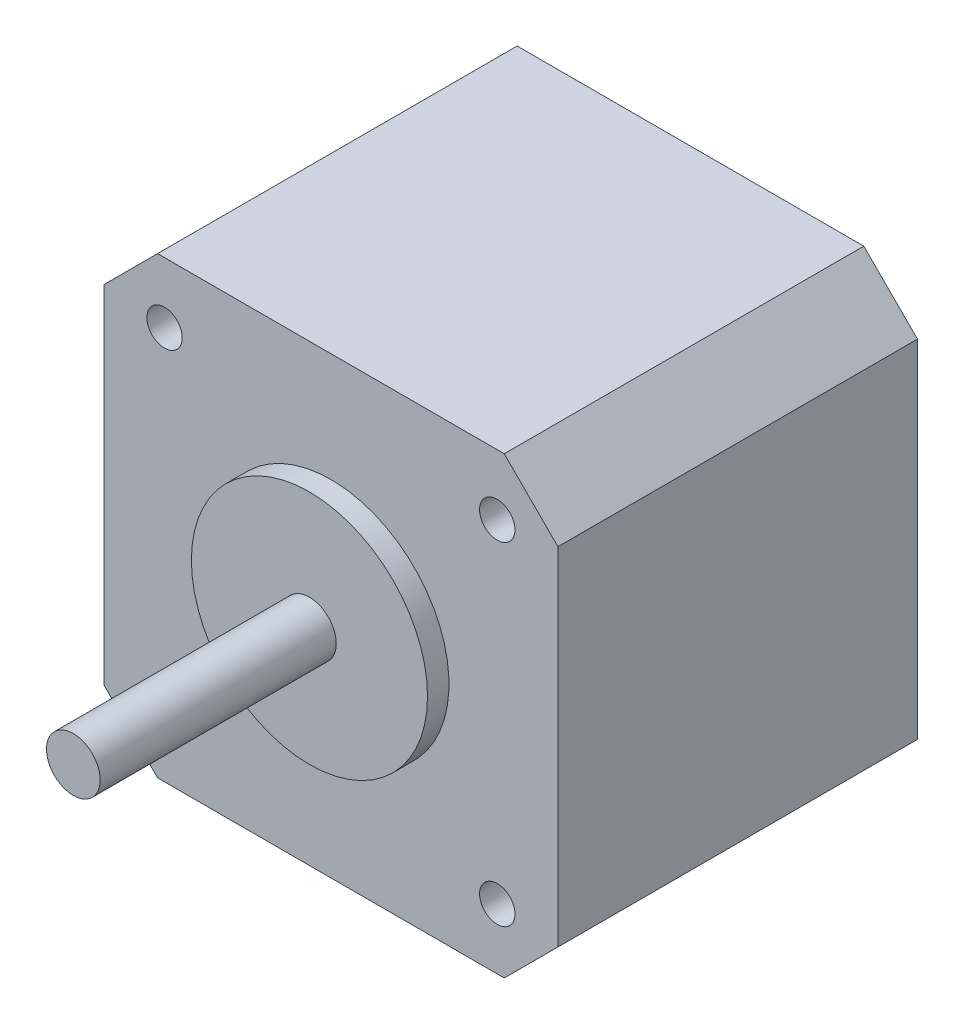
ISO-10303-21;
HEADER;
FILE_DESCRIPTION(('STEP AP214'),'2;1');
FILE_NAME('part.step','',(''),(''),'','','');
FILE_SCHEMA(('AUTOMOTIVE_DESIGN { 1 0 10303 214 1 1 1 1 }'));
ENDSEC;
DATA;
#1=APPLICATION_CONTEXT('core data for automotive mechanical design processes');
#2=APPLICATION_PROTOCOL_DEFINITION('international standard','automotive_design',2000,#1);
#3=PRODUCT_CONTEXT('',#1,'mechanical');
#4=PRODUCT('Part','Part','',(#3));
#5=PRODUCT_RELATED_PRODUCT_CATEGORY('part','',(#4));
#6=PRODUCT_DEFINITION_FORMATION('','',#4);
#7=PRODUCT_DEFINITION_CONTEXT('part definition',#1,'design');
#8=PRODUCT_DEFINITION('design','',#6,#7);
#9=PRODUCT_DEFINITION_SHAPE('','',#8);
#10=(LENGTH_UNIT() NAMED_UNIT(*) SI_UNIT(.MILLI.,.METRE.));
#11=(NAMED_UNIT(*) PLANE_ANGLE_UNIT() SI_UNIT($,.RADIAN.));
#12=(NAMED_UNIT(*) SI_UNIT($,.STERADIAN.) SOLID_ANGLE_UNIT());
#13=UNCERTAINTY_MEASURE_WITH_UNIT(LENGTH_MEASURE(1.E-05),#10,'distance_accuracy_value','');
#14=(GEOMETRIC_REPRESENTATION_CONTEXT(3) GLOBAL_UNCERTAINTY_ASSIGNED_CONTEXT((#13)) GLOBAL_UNIT_ASSIGNED_CONTEXT((#10,
#11,#12)) REPRESENTATION_CONTEXT('',''));
#15=CARTESIAN_POINT('',(0.,0.,0.));
#16=DIRECTION('',(0.,0.,1.));
#17=DIRECTION('',(1.,0.,0.));
#18=AXIS2_PLACEMENT_3D('',#15,#16,#17);
#19=CARTESIAN_POINT('',(0.,0.,33.5));
#20=DIRECTION('',(0.,1.,0.));
#21=DIRECTION('',(0.,0.,1.));
#22=AXIS2_PLACEMENT_3D('',#19,#20,#21);
#23=PLANE('',#22);
#24=DIRECTION('',(1.,0.,0.));
#25=VECTOR('',#24,1.);
#26=CARTESIAN_POINT('',(0.,0.,33.5));
#27=LINE('',#26,#25);
#28=CARTESIAN_POINT('',(5.00000000000002,0.,33.5));
#29=VERTEX_POINT('',#28);
#30=CARTESIAN_POINT('',(37.3,0.,33.5));
#31=VERTEX_POINT('',#30);
#32=EDGE_CURVE('E247',#29,#31,#27,.T.);
#33=ORIENTED_EDGE('',*,*,#32,.F.);
#34=DIRECTION('',(0.,0.,-1.));
#35=VECTOR('',#34,1.);
#36=CARTESIAN_POINT('',(5.00000000000002,0.,33.5));
#37=LINE('',#36,#35);
#38=CARTESIAN_POINT('',(5.00000000000003,0.,0.));
#39=VERTEX_POINT('',#38);
#40=EDGE_CURVE('E338',#29,#39,#37,.T.);
#41=ORIENTED_EDGE('',*,*,#40,.T.);
#42=DIRECTION('',(1.,0.,0.));
#43=VECTOR('',#42,1.);
#44=CARTESIAN_POINT('',(0.,0.,0.));
#45=LINE('',#44,#43);
#46=CARTESIAN_POINT('',(10.5,0.,0.));
#47=VERTEX_POINT('',#46);
#48=EDGE_CURVE('E169',#39,#47,#45,.T.);
#49=ORIENTED_EDGE('',*,*,#48,.T.);
#50=DIRECTION('',(0.,0.,-1.));
#51=VECTOR('',#50,1.);
#52=CARTESIAN_POINT('',(10.5,0.,7.15));
#53=LINE('',#52,#51);
#54=CARTESIAN_POINT('',(10.5,0.,7.15));
#55=VERTEX_POINT('',#54);
#56=EDGE_CURVE('E160',#55,#47,#53,.T.);
#57=ORIENTED_EDGE('',*,*,#56,.F.);
#58=DIRECTION('',(1.,0.,0.));
#59=VECTOR('',#58,1.);
#60=CARTESIAN_POINT('',(31.8,0.,7.15));
#61=LINE('',#60,#59);
#62=CARTESIAN_POINT('',(31.8,0.,7.15));
#63=VERTEX_POINT('',#62);
#64=EDGE_CURVE('E131',#55,#63,#61,.T.);
#65=ORIENTED_EDGE('',*,*,#64,.T.);
#66=DIRECTION('',(0.,0.,-1.));
#67=VECTOR('',#66,1.);
#68=CARTESIAN_POINT('',(31.8,0.,7.15));
#69=LINE('',#68,#67);
#70=CARTESIAN_POINT('',(31.8,0.,0.));
#71=VERTEX_POINT('',#70);
#72=EDGE_CURVE('E144',#63,#71,#69,.T.);
#73=ORIENTED_EDGE('',*,*,#72,.T.);
#74=CARTESIAN_POINT('',(37.3,0.,0.));
#75=VERTEX_POINT('',#74);
#76=EDGE_CURVE('E173',#71,#75,#45,.T.);
#77=ORIENTED_EDGE('',*,*,#76,.T.);
#78=DIRECTION('',(0.,0.,1.));
#79=VECTOR('',#78,1.);
#80=CARTESIAN_POINT('',(37.3,0.,33.5));
#81=LINE('',#80,#79);
#82=EDGE_CURVE('E174',#75,#31,#81,.T.);
#83=ORIENTED_EDGE('',*,*,#82,.T.);
#84=EDGE_LOOP('',(#33,#41,#49,#57,#65,#73,#77,#83));
#85=FACE_BOUND('',#84,.T.);
#86=ADVANCED_FACE('F31',(#85),#23,.F.);
#87=CARTESIAN_POINT('',(0.,42.3,33.5));
#88=DIRECTION('',(0.,0.,-1.));
#89=DIRECTION('',(-1.,0.,0.));
#90=AXIS2_PLACEMENT_3D('',#87,#88,#89);
#91=PLANE('',#90);
#92=DIRECTION('',(0.,-1.,0.));
#93=VECTOR('',#92,1.);
#94=CARTESIAN_POINT('',(0.,0.,33.5));
#95=LINE('',#94,#93);
#96=CARTESIAN_POINT('',(0.,37.3,33.5));
#97=VERTEX_POINT('',#96);
#98=CARTESIAN_POINT('',(0.,5.00000000000002,33.5));
#99=VERTEX_POINT('',#98);
#100=EDGE_CURVE('E246',#97,#99,#95,.T.);
#101=ORIENTED_EDGE('',*,*,#100,.T.);
#102=DIRECTION('',(-0.707106781186548,0.707106781186548,0.));
#103=VECTOR('',#102,1.);
#104=CARTESIAN_POINT('',(5.00000000000002,0.,33.5));
#105=LINE('',#104,#103);
#106=EDGE_CURVE('E219',#99,#29,#105,.F.);
#107=ORIENTED_EDGE('',*,*,#106,.T.);
#108=ORIENTED_EDGE('',*,*,#32,.T.);
#109=DIRECTION('',(-0.707106781186547,-0.707106781186549,0.));
#110=VECTOR('',#109,1.);
#111=CARTESIAN_POINT('',(42.3,5.00000000000002,33.5));
#112=LINE('',#111,#110);
#113=CARTESIAN_POINT('',(42.3,5.00000000000002,33.5));
#114=VERTEX_POINT('',#113);
#115=EDGE_CURVE('E226',#31,#114,#112,.F.);
#116=ORIENTED_EDGE('',*,*,#115,.T.);
#117=DIRECTION('',(0.,1.,0.));
#118=VECTOR('',#117,1.);
#119=CARTESIAN_POINT('',(42.3,0.,33.5));
#120=LINE('',#119,#118);
#121=CARTESIAN_POINT('',(42.3,37.3,33.5));
#122=VERTEX_POINT('',#121);
#123=EDGE_CURVE('E240',#114,#122,#120,.T.);
#124=ORIENTED_EDGE('',*,*,#123,.T.);
#125=DIRECTION('',(0.707106781186548,-0.707106781186548,0.));
#126=VECTOR('',#125,1.);
#127=CARTESIAN_POINT('',(37.3,42.3,33.5));
#128=LINE('',#127,#126);
#129=CARTESIAN_POINT('',(37.3,42.3,33.5));
#130=VERTEX_POINT('',#129);
#131=EDGE_CURVE('E52',#122,#130,#128,.F.);
#132=ORIENTED_EDGE('',*,*,#131,.T.);
#133=DIRECTION('',(-1.,0.,0.));
#134=VECTOR('',#133,1.);
#135=CARTESIAN_POINT('',(0.,42.3,33.5));
#136=LINE('',#135,#134);
#137=CARTESIAN_POINT('',(5.00000000000002,42.3,33.5));
#138=VERTEX_POINT('',#137);
#139=EDGE_CURVE('E251',#130,#138,#136,.T.);
#140=ORIENTED_EDGE('',*,*,#139,.T.);
#141=DIRECTION('',(0.707106781186548,0.707106781186548,0.));
#142=VECTOR('',#141,1.);
#143=CARTESIAN_POINT('',(0.,37.3,33.5));
#144=LINE('',#143,#142);
#145=EDGE_CURVE('E220',#138,#97,#144,.F.);
#146=ORIENTED_EDGE('',*,*,#145,.T.);
#147=EDGE_LOOP('',(#101,#107,#108,#116,#124,#132,#140,#146));
#148=FACE_BOUND('',#147,.T.);
#149=CARTESIAN_POINT('',(5.65,36.65,33.5));
#150=DIRECTION('',(0.,0.,1.));
#151=DIRECTION('',(1.,0.,0.));
#152=AXIS2_PLACEMENT_3D('',#149,#150,#151);
#153=CIRCLE('',#152,1.65);
#154=CARTESIAN_POINT('',(7.3,36.65,33.5));
#155=VERTEX_POINT('',#154);
#156=EDGE_CURVE('E261',#155,#155,#153,.T.);
#157=ORIENTED_EDGE('',*,*,#156,.F.);
#158=EDGE_LOOP('',(#157));
#159=FACE_BOUND('',#158,.T.);
#160=CARTESIAN_POINT('',(36.65,36.65,33.5));
#161=DIRECTION('',(0.,0.,1.));
#162=DIRECTION('',(1.,0.,0.));
#163=AXIS2_PLACEMENT_3D('',#160,#161,#162);
#164=CIRCLE('',#163,1.65);
#165=CARTESIAN_POINT('',(38.3,36.65,33.5));
#166=VERTEX_POINT('',#165);
#167=EDGE_CURVE('E267',#166,#166,#164,.T.);
#168=ORIENTED_EDGE('',*,*,#167,.F.);
#169=EDGE_LOOP('',(#168));
#170=FACE_BOUND('',#169,.T.);
#171=CARTESIAN_POINT('',(5.65000000000032,5.65,33.5));
#172=DIRECTION('',(0.,0.,1.));
#173=DIRECTION('',(1.,0.,0.));
#174=AXIS2_PLACEMENT_3D('',#171,#172,#173);
#175=CIRCLE('',#174,1.65);
#176=CARTESIAN_POINT('',(7.30000000000032,5.65,33.5));
#177=VERTEX_POINT('',#176);
#178=EDGE_CURVE('E273',#177,#177,#175,.T.);
#179=ORIENTED_EDGE('',*,*,#178,.F.);
#180=EDGE_LOOP('',(#179));
#181=FACE_BOUND('',#180,.T.);
#182=CARTESIAN_POINT('',(36.6500000000003,5.65,33.5));
#183=DIRECTION('',(0.,0.,1.));
#184=DIRECTION('',(1.,0.,0.));
#185=AXIS2_PLACEMENT_3D('',#182,#183,#184);
#186=CIRCLE('',#185,1.65);
#187=CARTESIAN_POINT('',(38.3000000000003,5.65,33.5));
#188=VERTEX_POINT('',#187);
#189=EDGE_CURVE('E279',#188,#188,#186,.T.);
#190=ORIENTED_EDGE('',*,*,#189,.F.);
#191=EDGE_LOOP('',(#190));
#192=FACE_BOUND('',#191,.T.);
#193=CARTESIAN_POINT('',(21.15,21.15,33.5));
#194=DIRECTION('',(0.,0.,-1.));
#195=DIRECTION('',(-1.,0.,0.));
#196=AXIS2_PLACEMENT_3D('',#193,#194,#195);
#197=CIRCLE('',#196,11.);
#198=CARTESIAN_POINT('',(10.15,21.15,33.5));
#199=VERTEX_POINT('',#198);
#200=EDGE_CURVE('E249',#199,#199,#197,.F.);
#201=ORIENTED_EDGE('',*,*,#200,.F.);
#202=EDGE_LOOP('',(#201));
#203=FACE_BOUND('',#202,.T.);
#204=ADVANCED_FACE('F313',(#148,#159,#170,#181,#192,#203),#91,.F.);
#205=CARTESIAN_POINT('',(0.,0.,33.5));
#206=DIRECTION('',(1.,0.,0.));
#207=DIRECTION('',(0.,0.,-1.));
#208=AXIS2_PLACEMENT_3D('',#205,#206,#207);
#209=PLANE('',#208);
#210=DIRECTION('',(0.,-1.,0.));
#211=VECTOR('',#210,1.);
#212=CARTESIAN_POINT('',(0.,0.,0.));
#213=LINE('',#212,#211);
#214=CARTESIAN_POINT('',(0.,37.3,0.));
#215=VERTEX_POINT('',#214);
#216=CARTESIAN_POINT('',(0.,5.00000000000002,0.));
#217=VERTEX_POINT('',#216);
#218=EDGE_CURVE('E179',#215,#217,#213,.T.);
#219=ORIENTED_EDGE('',*,*,#218,.T.);
#220=DIRECTION('',(0.,0.,1.));
#221=VECTOR('',#220,1.);
#222=CARTESIAN_POINT('',(0.,5.00000000000002,33.5));
#223=LINE('',#222,#221);
#224=EDGE_CURVE('E213',#217,#99,#223,.T.);
#225=ORIENTED_EDGE('',*,*,#224,.T.);
#226=ORIENTED_EDGE('',*,*,#100,.F.);
#227=DIRECTION('',(0.,0.,-1.));
#228=VECTOR('',#227,1.);
#229=CARTESIAN_POINT('',(0.,37.3,33.5));
#230=LINE('',#229,#228);
#231=EDGE_CURVE('E206',#97,#215,#230,.T.);
#232=ORIENTED_EDGE('',*,*,#231,.T.);
#233=EDGE_LOOP('',(#219,#225,#226,#232));
#234=FACE_BOUND('',#233,.T.);
#235=ADVANCED_FACE('F211',(#234),#209,.F.);
#236=CARTESIAN_POINT('',(42.3,0.,33.5));
#237=DIRECTION('',(-1.,0.,0.));
#238=DIRECTION('',(0.,0.,1.));
#239=AXIS2_PLACEMENT_3D('',#236,#237,#238);
#240=PLANE('',#239);
#241=ORIENTED_EDGE('',*,*,#123,.F.);
#242=DIRECTION('',(0.,0.,-1.));
#243=VECTOR('',#242,1.);
#244=CARTESIAN_POINT('',(42.3,5.00000000000002,33.5));
#245=LINE('',#244,#243);
#246=CARTESIAN_POINT('',(42.3,5.,0.));
#247=VERTEX_POINT('',#246);
#248=EDGE_CURVE('E231',#114,#247,#245,.T.);
#249=ORIENTED_EDGE('',*,*,#248,.T.);
#250=DIRECTION('',(0.,1.,0.));
#251=VECTOR('',#250,1.);
#252=CARTESIAN_POINT('',(42.3,0.,0.));
#253=LINE('',#252,#251);
#254=CARTESIAN_POINT('',(42.3,37.3,0.));
#255=VERTEX_POINT('',#254);
#256=EDGE_CURVE('E172',#247,#255,#253,.T.);
#257=ORIENTED_EDGE('',*,*,#256,.T.);
#258=DIRECTION('',(0.,0.,1.));
#259=VECTOR('',#258,1.);
#260=CARTESIAN_POINT('',(42.3,37.3,33.5));
#261=LINE('',#260,#259);
#262=EDGE_CURVE('E229',#255,#122,#261,.T.);
#263=ORIENTED_EDGE('',*,*,#262,.T.);
#264=EDGE_LOOP('',(#241,#249,#257,#263));
#265=FACE_BOUND('',#264,.T.);
#266=ADVANCED_FACE('F238',(#265),#240,.F.);
#267=CARTESIAN_POINT('',(0.,42.3,33.5));
#268=DIRECTION('',(0.,-1.,0.));
#269=DIRECTION('',(0.,0.,-1.));
#270=AXIS2_PLACEMENT_3D('',#267,#268,#269);
#271=PLANE('',#270);
#272=ORIENTED_EDGE('',*,*,#139,.F.);
#273=DIRECTION('',(0.,0.,-1.));
#274=VECTOR('',#273,1.);
#275=CARTESIAN_POINT('',(37.3,42.3,33.5));
#276=LINE('',#275,#274);
#277=CARTESIAN_POINT('',(37.3,42.3,0.));
#278=VERTEX_POINT('',#277);
#279=EDGE_CURVE('E11',#130,#278,#276,.T.);
#280=ORIENTED_EDGE('',*,*,#279,.T.);
#281=DIRECTION('',(-1.,0.,0.));
#282=VECTOR('',#281,1.);
#283=CARTESIAN_POINT('',(0.,42.3,0.));
#284=LINE('',#283,#282);
#285=CARTESIAN_POINT('',(5.00000000000002,42.3,0.));
#286=VERTEX_POINT('',#285);
#287=EDGE_CURVE('E245',#278,#286,#284,.T.);
#288=ORIENTED_EDGE('',*,*,#287,.T.);
#289=DIRECTION('',(0.,0.,1.));
#290=VECTOR('',#289,1.);
#291=CARTESIAN_POINT('',(5.00000000000002,42.3,33.5));
#292=LINE('',#291,#290);
#293=EDGE_CURVE('E39',#286,#138,#292,.T.);
#294=ORIENTED_EDGE('',*,*,#293,.T.);
#295=EDGE_LOOP('',(#272,#280,#288,#294));
#296=FACE_BOUND('',#295,.T.);
#297=ADVANCED_FACE('F336',(#296),#271,.F.);
#298=CARTESIAN_POINT('',(0.,42.3,0.));
#299=DIRECTION('',(0.,0.,-1.));
#300=DIRECTION('',(-1.,0.,0.));
#301=AXIS2_PLACEMENT_3D('',#298,#299,#300);
#302=PLANE('',#301);
#303=CARTESIAN_POINT('',(21.15,21.15,0.));
#304=DIRECTION('',(0.,0.,-1.));
#305=DIRECTION('',(-1.,0.,0.));
#306=AXIS2_PLACEMENT_3D('',#303,#304,#305);
#307=CIRCLE('',#306,2.5);
#308=CARTESIAN_POINT('',(18.65,21.15,0.));
#309=VERTEX_POINT('',#308);
#310=EDGE_CURVE('E255',#309,#309,#307,.T.);
#311=ORIENTED_EDGE('',*,*,#310,.F.);
#312=EDGE_LOOP('',(#311));
#313=FACE_BOUND('',#312,.T.);
#314=ORIENTED_EDGE('',*,*,#48,.F.);
#315=DIRECTION('',(0.707106781186548,-0.707106781186548,0.));
#316=VECTOR('',#315,1.);
#317=CARTESIAN_POINT('',(-18.65,23.65,0.));
#318=LINE('',#317,#316);
#319=EDGE_CURVE('E201',#39,#217,#318,.F.);
#320=ORIENTED_EDGE('',*,*,#319,.T.);
#321=ORIENTED_EDGE('',*,*,#218,.F.);
#322=DIRECTION('',(-0.707106781186548,-0.707106781186548,0.));
#323=VECTOR('',#322,1.);
#324=CARTESIAN_POINT('',(2.50000000000001,39.8,0.));
#325=LINE('',#324,#323);
#326=EDGE_CURVE('E337',#215,#286,#325,.F.);
#327=ORIENTED_EDGE('',*,*,#326,.T.);
#328=ORIENTED_EDGE('',*,*,#287,.F.);
#329=DIRECTION('',(-0.707106781186548,0.707106781186548,0.));
#330=VECTOR('',#329,1.);
#331=CARTESIAN_POINT('',(18.65,60.95,0.));
#332=LINE('',#331,#330);
#333=EDGE_CURVE('E244',#278,#255,#332,.F.);
#334=ORIENTED_EDGE('',*,*,#333,.T.);
#335=ORIENTED_EDGE('',*,*,#256,.F.);
#336=DIRECTION('',(0.707106781186547,0.707106781186549,0.));
#337=VECTOR('',#336,1.);
#338=CARTESIAN_POINT('',(39.8000000000001,2.50000000000006,0.));
#339=LINE('',#338,#337);
#340=EDGE_CURVE('E207',#247,#75,#339,.F.);
#341=ORIENTED_EDGE('',*,*,#340,.T.);
#342=ORIENTED_EDGE('',*,*,#76,.F.);
#343=DIRECTION('',(0.,-1.,0.));
#344=VECTOR('',#343,1.);
#345=CARTESIAN_POINT('',(31.8,0.,0.));
#346=LINE('',#345,#344);
#347=CARTESIAN_POINT('',(31.8,-2.8,0.));
#348=VERTEX_POINT('',#347);
#349=EDGE_CURVE('E153',#71,#348,#346,.T.);
#350=ORIENTED_EDGE('',*,*,#349,.T.);
#351=DIRECTION('',(-1.,0.,0.));
#352=VECTOR('',#351,1.);
#353=CARTESIAN_POINT('',(31.8,-2.8,0.));
#354=LINE('',#353,#352);
#355=CARTESIAN_POINT('',(10.5,-2.8,0.));
#356=VERTEX_POINT('',#355);
#357=EDGE_CURVE('E126',#348,#356,#354,.T.);
#358=ORIENTED_EDGE('',*,*,#357,.T.);
#359=DIRECTION('',(0.,1.,0.));
#360=VECTOR('',#359,1.);
#361=CARTESIAN_POINT('',(10.5,0.,0.));
#362=LINE('',#361,#360);
#363=EDGE_CURVE('E145',#356,#47,#362,.T.);
#364=ORIENTED_EDGE('',*,*,#363,.T.);
#365=EDGE_LOOP('',(#314,#320,#321,#327,#328,#334,#335,#341,#342,#350,#358,#364));
#366=FACE_BOUND('',#365,.T.);
#367=ADVANCED_FACE('F191',(#313,#366),#302,.T.);
#368=CARTESIAN_POINT('',(5.65,36.65,23.5));
#369=DIRECTION('',(0.,0.,1.));
#370=DIRECTION('',(1.,0.,0.));
#371=AXIS2_PLACEMENT_3D('',#368,#369,#370);
#372=CYLINDRICAL_SURFACE('',#371,1.65);
#373=CARTESIAN_POINT('',(5.65,36.65,23.5));
#374=DIRECTION('',(0.,0.,1.));
#375=DIRECTION('',(1.,0.,0.));
#376=AXIS2_PLACEMENT_3D('',#373,#374,#375);
#377=CIRCLE('',#376,1.65);
#378=CARTESIAN_POINT('',(7.3,36.65,23.5));
#379=VERTEX_POINT('',#378);
#380=EDGE_CURVE('E216',#379,#379,#377,.T.);
#381=ORIENTED_EDGE('',*,*,#380,.F.);
#382=EDGE_LOOP('',(#381));
#383=FACE_BOUND('',#382,.T.);
#384=ORIENTED_EDGE('',*,*,#156,.T.);
#385=EDGE_LOOP('',(#384));
#386=FACE_BOUND('',#385,.T.);
#387=ADVANCED_FACE('F385',(#383,#386),#372,.F.);
#388=CARTESIAN_POINT('',(5.65,36.65,23.5));
#389=DIRECTION('',(0.,0.,1.));
#390=DIRECTION('',(1.,0.,0.));
#391=AXIS2_PLACEMENT_3D('',#388,#389,#390);
#392=PLANE('',#391);
#393=ORIENTED_EDGE('',*,*,#380,.T.);
#394=EDGE_LOOP('',(#393));
#395=FACE_BOUND('',#394,.T.);
#396=ADVANCED_FACE('F381',(#395),#392,.T.);
#397=CARTESIAN_POINT('',(36.65,36.65,23.5));
#398=DIRECTION('',(0.,0.,1.));
#399=DIRECTION('',(1.,0.,0.));
#400=AXIS2_PLACEMENT_3D('',#397,#398,#399);
#401=CYLINDRICAL_SURFACE('',#400,1.65);
#402=CARTESIAN_POINT('',(36.65,36.65,23.5));
#403=DIRECTION('',(0.,0.,1.));
#404=DIRECTION('',(1.,0.,0.));
#405=AXIS2_PLACEMENT_3D('',#402,#403,#404);
#406=CIRCLE('',#405,1.65);
#407=CARTESIAN_POINT('',(38.3,36.65,23.5));
#408=VERTEX_POINT('',#407);
#409=EDGE_CURVE('E264',#408,#408,#406,.T.);
#410=ORIENTED_EDGE('',*,*,#409,.F.);
#411=EDGE_LOOP('',(#410));
#412=FACE_BOUND('',#411,.T.);
#413=ORIENTED_EDGE('',*,*,#167,.T.);
#414=EDGE_LOOP('',(#413));
#415=FACE_BOUND('',#414,.T.);
#416=ADVANCED_FACE('F377',(#412,#415),#401,.F.);
#417=CARTESIAN_POINT('',(36.65,36.65,23.5));
#418=DIRECTION('',(0.,0.,1.));
#419=DIRECTION('',(1.,0.,0.));
#420=AXIS2_PLACEMENT_3D('',#417,#418,#419);
#421=PLANE('',#420);
#422=ORIENTED_EDGE('',*,*,#409,.T.);
#423=EDGE_LOOP('',(#422));
#424=FACE_BOUND('',#423,.T.);
#425=ADVANCED_FACE('F373',(#424),#421,.T.);
#426=CARTESIAN_POINT('',(5.65000000000032,5.65,23.5));
#427=DIRECTION('',(0.,0.,1.));
#428=DIRECTION('',(1.,0.,0.));
#429=AXIS2_PLACEMENT_3D('',#426,#427,#428);
#430=CYLINDRICAL_SURFACE('',#429,1.65);
#431=CARTESIAN_POINT('',(5.65000000000032,5.65,23.5));
#432=DIRECTION('',(0.,0.,1.));
#433=DIRECTION('',(1.,0.,0.));
#434=AXIS2_PLACEMENT_3D('',#431,#432,#433);
#435=CIRCLE('',#434,1.65);
#436=CARTESIAN_POINT('',(7.30000000000032,5.65,23.5));
#437=VERTEX_POINT('',#436);
#438=EDGE_CURVE('E270',#437,#437,#435,.T.);
#439=ORIENTED_EDGE('',*,*,#438,.F.);
#440=EDGE_LOOP('',(#439));
#441=FACE_BOUND('',#440,.T.);
#442=ORIENTED_EDGE('',*,*,#178,.T.);
#443=EDGE_LOOP('',(#442));
#444=FACE_BOUND('',#443,.T.);
#445=ADVANCED_FACE('F365',(#441,#444),#430,.F.);
#446=CARTESIAN_POINT('',(5.65000000000032,5.65,23.5));
#447=DIRECTION('',(0.,0.,1.));
#448=DIRECTION('',(1.,0.,0.));
#449=AXIS2_PLACEMENT_3D('',#446,#447,#448);
#450=PLANE('',#449);
#451=ORIENTED_EDGE('',*,*,#438,.T.);
#452=EDGE_LOOP('',(#451));
#453=FACE_BOUND('',#452,.T.);
#454=ADVANCED_FACE('F355',(#453),#450,.T.);
#455=CARTESIAN_POINT('',(36.6500000000003,5.65,23.5));
#456=DIRECTION('',(0.,0.,1.));
#457=DIRECTION('',(1.,0.,0.));
#458=AXIS2_PLACEMENT_3D('',#455,#456,#457);
#459=CYLINDRICAL_SURFACE('',#458,1.65);
#460=CARTESIAN_POINT('',(36.6500000000003,5.65,23.5));
#461=DIRECTION('',(0.,0.,1.));
#462=DIRECTION('',(1.,0.,0.));
#463=AXIS2_PLACEMENT_3D('',#460,#461,#462);
#464=CIRCLE('',#463,1.65);
#465=CARTESIAN_POINT('',(38.3000000000003,5.65,23.5));
#466=VERTEX_POINT('',#465);
#467=EDGE_CURVE('E276',#466,#466,#464,.T.);
#468=ORIENTED_EDGE('',*,*,#467,.F.);
#469=EDGE_LOOP('',(#468));
#470=FACE_BOUND('',#469,.T.);
#471=ORIENTED_EDGE('',*,*,#189,.T.);
#472=EDGE_LOOP('',(#471));
#473=FACE_BOUND('',#472,.T.);
#474=ADVANCED_FACE('F352',(#470,#473),#459,.F.);
#475=CARTESIAN_POINT('',(36.6500000000003,5.65,23.5));
#476=DIRECTION('',(0.,0.,1.));
#477=DIRECTION('',(1.,0.,0.));
#478=AXIS2_PLACEMENT_3D('',#475,#476,#477);
#479=PLANE('',#478);
#480=ORIENTED_EDGE('',*,*,#467,.T.);
#481=EDGE_LOOP('',(#480));
#482=FACE_BOUND('',#481,.T.);
#483=ADVANCED_FACE('F354',(#482),#479,.T.);
#484=CARTESIAN_POINT('',(21.15,21.15,35.5));
#485=DIRECTION('',(0.,0.,-1.));
#486=DIRECTION('',(-1.,0.,0.));
#487=AXIS2_PLACEMENT_3D('',#484,#485,#486);
#488=CYLINDRICAL_SURFACE('',#487,11.);
#489=CARTESIAN_POINT('',(21.15,21.15,35.5));
#490=DIRECTION('',(0.,0.,1.));
#491=DIRECTION('',(1.,0.,0.));
#492=AXIS2_PLACEMENT_3D('',#489,#490,#491);
#493=CIRCLE('',#492,11.);
#494=CARTESIAN_POINT('',(32.15,21.15,35.5));
#495=VERTEX_POINT('',#494);
#496=EDGE_CURVE('E282',#495,#495,#493,.T.);
#497=ORIENTED_EDGE('',*,*,#496,.F.);
#498=EDGE_LOOP('',(#497));
#499=FACE_BOUND('',#498,.T.);
#500=ORIENTED_EDGE('',*,*,#200,.T.);
#501=EDGE_LOOP('',(#500));
#502=FACE_BOUND('',#501,.T.);
#503=ADVANCED_FACE('F362',(#499,#502),#488,.T.);
#504=CARTESIAN_POINT('',(21.15,21.15,35.5));
#505=DIRECTION('',(0.,0.,1.));
#506=DIRECTION('',(1.,0.,0.));
#507=AXIS2_PLACEMENT_3D('',#504,#505,#506);
#508=PLANE('',#507);
#509=CARTESIAN_POINT('',(21.15,21.15,35.5));
#510=DIRECTION('',(0.,0.,1.));
#511=DIRECTION('',(1.,0.,0.));
#512=AXIS2_PLACEMENT_3D('',#509,#510,#511);
#513=CIRCLE('',#512,2.5);
#514=CARTESIAN_POINT('',(23.65,21.15,35.5));
#515=VERTEX_POINT('',#514);
#516=EDGE_CURVE('E186',#515,#515,#513,.T.);
#517=ORIENTED_EDGE('',*,*,#516,.F.);
#518=EDGE_LOOP('',(#517));
#519=FACE_BOUND('',#518,.T.);
#520=ORIENTED_EDGE('',*,*,#496,.T.);
#521=EDGE_LOOP('',(#520));
#522=FACE_BOUND('',#521,.T.);
#523=ADVANCED_FACE('F308',(#519,#522),#508,.T.);
#524=CARTESIAN_POINT('',(21.15,21.15,57.5));
#525=DIRECTION('',(0.,0.,1.));
#526=DIRECTION('',(1.,0.,0.));
#527=AXIS2_PLACEMENT_3D('',#524,#525,#526);
#528=PLANE('',#527);
#529=CARTESIAN_POINT('',(21.15,21.15,57.5));
#530=DIRECTION('',(0.,0.,1.));
#531=DIRECTION('',(1.,0.,0.));
#532=AXIS2_PLACEMENT_3D('',#529,#530,#531);
#533=CIRCLE('',#532,2.5);
#534=CARTESIAN_POINT('',(23.65,21.15,57.5));
#535=VERTEX_POINT('',#534);
#536=EDGE_CURVE('E159',#535,#535,#533,.T.);
#537=ORIENTED_EDGE('',*,*,#536,.T.);
#538=EDGE_LOOP('',(#537));
#539=FACE_BOUND('',#538,.T.);
#540=ADVANCED_FACE('F295',(#539),#528,.T.);
#541=CARTESIAN_POINT('',(21.15,21.15,-9.5));
#542=DIRECTION('',(0.,0.,1.));
#543=DIRECTION('',(1.,0.,0.));
#544=AXIS2_PLACEMENT_3D('',#541,#542,#543);
#545=CYLINDRICAL_SURFACE('',#544,2.5);
#546=ORIENTED_EDGE('',*,*,#516,.T.);
#547=EDGE_LOOP('',(#546));
#548=FACE_BOUND('',#547,.T.);
#549=ORIENTED_EDGE('',*,*,#536,.F.);
#550=EDGE_LOOP('',(#549));
#551=FACE_BOUND('',#550,.T.);
#552=ADVANCED_FACE('F297',(#548,#551),#545,.T.);
#553=ORIENTED_EDGE('',*,*,#310,.T.);
#554=EDGE_LOOP('',(#553));
#555=FACE_BOUND('',#554,.T.);
#556=CARTESIAN_POINT('',(21.15,21.15,-9.5));
#557=DIRECTION('',(0.,0.,1.));
#558=DIRECTION('',(1.,0.,0.));
#559=AXIS2_PLACEMENT_3D('',#556,#557,#558);
#560=CIRCLE('',#559,2.5);
#561=CARTESIAN_POINT('',(23.65,21.15,-9.5));
#562=VERTEX_POINT('',#561);
#563=EDGE_CURVE('E287',#562,#562,#560,.T.);
#564=ORIENTED_EDGE('',*,*,#563,.T.);
#565=EDGE_LOOP('',(#564));
#566=FACE_BOUND('',#565,.T.);
#567=ADVANCED_FACE('F299',(#555,#566),#545,.T.);
#568=CARTESIAN_POINT('',(21.15,21.15,-9.5));
#569=DIRECTION('',(0.,0.,1.));
#570=DIRECTION('',(1.,0.,0.));
#571=AXIS2_PLACEMENT_3D('',#568,#569,#570);
#572=PLANE('',#571);
#573=ORIENTED_EDGE('',*,*,#563,.F.);
#574=EDGE_LOOP('',(#573));
#575=FACE_BOUND('',#574,.T.);
#576=ADVANCED_FACE('F306',(#575),#572,.F.);
#577=CARTESIAN_POINT('',(31.8,0.,7.15));
#578=DIRECTION('',(1.,0.,0.));
#579=DIRECTION('',(0.,0.,-1.));
#580=AXIS2_PLACEMENT_3D('',#577,#578,#579);
#581=PLANE('',#580);
#582=ORIENTED_EDGE('',*,*,#349,.F.);
#583=ORIENTED_EDGE('',*,*,#72,.F.);
#584=DIRECTION('',(0.,-1.,0.));
#585=VECTOR('',#584,1.);
#586=CARTESIAN_POINT('',(31.8,0.,7.15));
#587=LINE('',#586,#585);
#588=CARTESIAN_POINT('',(31.8,-2.8,7.15));
#589=VERTEX_POINT('',#588);
#590=EDGE_CURVE('E138',#63,#589,#587,.T.);
#591=ORIENTED_EDGE('',*,*,#590,.T.);
#592=DIRECTION('',(0.,0.,-1.));
#593=VECTOR('',#592,1.);
#594=CARTESIAN_POINT('',(31.8,-2.8,7.15));
#595=LINE('',#594,#593);
#596=EDGE_CURVE('E121',#589,#348,#595,.T.);
#597=ORIENTED_EDGE('',*,*,#596,.T.);
#598=EDGE_LOOP('',(#582,#583,#591,#597));
#599=FACE_BOUND('',#598,.T.);
#600=ADVANCED_FACE('F142',(#599),#581,.T.);
#601=CARTESIAN_POINT('',(10.5,0.,7.15));
#602=DIRECTION('',(-1.,0.,0.));
#603=DIRECTION('',(0.,-1.,0.));
#604=AXIS2_PLACEMENT_3D('',#601,#602,#603);
#605=PLANE('',#604);
#606=ORIENTED_EDGE('',*,*,#363,.F.);
#607=DIRECTION('',(0.,0.,-1.));
#608=VECTOR('',#607,1.);
#609=CARTESIAN_POINT('',(10.5,-2.8,7.15));
#610=LINE('',#609,#608);
#611=CARTESIAN_POINT('',(10.5,-2.8,7.15));
#612=VERTEX_POINT('',#611);
#613=EDGE_CURVE('E130',#612,#356,#610,.T.);
#614=ORIENTED_EDGE('',*,*,#613,.F.);
#615=DIRECTION('',(0.,1.,0.));
#616=VECTOR('',#615,1.);
#617=CARTESIAN_POINT('',(10.5,0.,7.15));
#618=LINE('',#617,#616);
#619=EDGE_CURVE('E140',#612,#55,#618,.T.);
#620=ORIENTED_EDGE('',*,*,#619,.T.);
#621=ORIENTED_EDGE('',*,*,#56,.T.);
#622=EDGE_LOOP('',(#606,#614,#620,#621));
#623=FACE_BOUND('',#622,.T.);
#624=ADVANCED_FACE('F199',(#623),#605,.T.);
#625=CARTESIAN_POINT('',(31.8,-2.8,7.15));
#626=DIRECTION('',(0.,-1.,0.));
#627=DIRECTION('',(0.,0.,-1.));
#628=AXIS2_PLACEMENT_3D('',#625,#626,#627);
#629=PLANE('',#628);
#630=ORIENTED_EDGE('',*,*,#357,.F.);
#631=ORIENTED_EDGE('',*,*,#596,.F.);
#632=DIRECTION('',(-1.,0.,0.));
#633=VECTOR('',#632,1.);
#634=CARTESIAN_POINT('',(31.8,-2.8,7.15));
#635=LINE('',#634,#633);
#636=EDGE_CURVE('E124',#589,#612,#635,.T.);
#637=ORIENTED_EDGE('',*,*,#636,.T.);
#638=ORIENTED_EDGE('',*,*,#613,.T.);
#639=EDGE_LOOP('',(#630,#631,#637,#638));
#640=FACE_BOUND('',#639,.T.);
#641=ADVANCED_FACE('F123',(#640),#629,.T.);
#642=CARTESIAN_POINT('',(31.8,-2.8,7.15));
#643=DIRECTION('',(0.,0.,-1.));
#644=DIRECTION('',(-1.,0.,0.));
#645=AXIS2_PLACEMENT_3D('',#642,#643,#644);
#646=PLANE('',#645);
#647=ORIENTED_EDGE('',*,*,#590,.F.);
#648=ORIENTED_EDGE('',*,*,#64,.F.);
#649=ORIENTED_EDGE('',*,*,#619,.F.);
#650=ORIENTED_EDGE('',*,*,#636,.F.);
#651=EDGE_LOOP('',(#647,#648,#649,#650));
#652=FACE_BOUND('',#651,.T.);
#653=ADVANCED_FACE('F136',(#652),#646,.F.);
#654=CARTESIAN_POINT('',(5.00000000000002,0.,33.5));
#655=DIRECTION('',(0.707106781186547,0.707106781186547,0.));
#656=DIRECTION('',(-0.707106781186548,0.707106781186548,0.));
#657=AXIS2_PLACEMENT_3D('',#654,#655,#656);
#658=PLANE('',#657);
#659=ORIENTED_EDGE('',*,*,#106,.F.);
#660=ORIENTED_EDGE('',*,*,#224,.F.);
#661=ORIENTED_EDGE('',*,*,#319,.F.);
#662=ORIENTED_EDGE('',*,*,#40,.F.);
#663=EDGE_LOOP('',(#659,#660,#661,#662));
#664=FACE_BOUND('',#663,.T.);
#665=ADVANCED_FACE('F218',(#664),#658,.F.);
#666=CARTESIAN_POINT('',(42.3,5.00000000000002,33.5));
#667=DIRECTION('',(-0.707106781186549,0.707106781186547,0.));
#668=DIRECTION('',(-0.707106781186547,-0.707106781186549,0.));
#669=AXIS2_PLACEMENT_3D('',#666,#667,#668);
#670=PLANE('',#669);
#671=ORIENTED_EDGE('',*,*,#115,.F.);
#672=ORIENTED_EDGE('',*,*,#82,.F.);
#673=ORIENTED_EDGE('',*,*,#340,.F.);
#674=ORIENTED_EDGE('',*,*,#248,.F.);
#675=EDGE_LOOP('',(#671,#672,#673,#674));
#676=FACE_BOUND('',#675,.T.);
#677=ADVANCED_FACE('F326',(#676),#670,.F.);
#678=CARTESIAN_POINT('',(37.3,42.3,33.5));
#679=DIRECTION('',(-0.707106781186547,-0.707106781186547,0.));
#680=DIRECTION('',(0.707106781186548,-0.707106781186548,0.));
#681=AXIS2_PLACEMENT_3D('',#678,#679,#680);
#682=PLANE('',#681);
#683=ORIENTED_EDGE('',*,*,#131,.F.);
#684=ORIENTED_EDGE('',*,*,#262,.F.);
#685=ORIENTED_EDGE('',*,*,#333,.F.);
#686=ORIENTED_EDGE('',*,*,#279,.F.);
#687=EDGE_LOOP('',(#683,#684,#685,#686));
#688=FACE_BOUND('',#687,.T.);
#689=ADVANCED_FACE('F328',(#688),#682,.F.);
#690=CARTESIAN_POINT('',(0.,37.3,33.5));
#691=DIRECTION('',(0.707106781186547,-0.707106781186547,0.));
#692=DIRECTION('',(0.707106781186548,0.707106781186548,0.));
#693=AXIS2_PLACEMENT_3D('',#690,#691,#692);
#694=PLANE('',#693);
#695=ORIENTED_EDGE('',*,*,#145,.F.);
#696=ORIENTED_EDGE('',*,*,#293,.F.);
#697=ORIENTED_EDGE('',*,*,#326,.F.);
#698=ORIENTED_EDGE('',*,*,#231,.F.);
#699=EDGE_LOOP('',(#695,#696,#697,#698));
#700=FACE_BOUND('',#699,.T.);
#701=ADVANCED_FACE('F33',(#700),#694,.F.);
#702=CLOSED_SHELL('',(#86,#204,#235,#266,#297,#367,#387,#396,#416,#425,#445,#454,#474,#483,#503,
#523,#540,#552,#567,#576,#600,#624,#641,#653,#665,#677,#689,#701));
#703=MANIFOLD_SOLID_BREP('B2',#702);
#704=ADVANCED_BREP_SHAPE_REPRESENTATION('',(#18,#703),#14);
#705=SHAPE_DEFINITION_REPRESENTATION(#9,#704);
ENDSEC;
END-ISO-10303-21;
